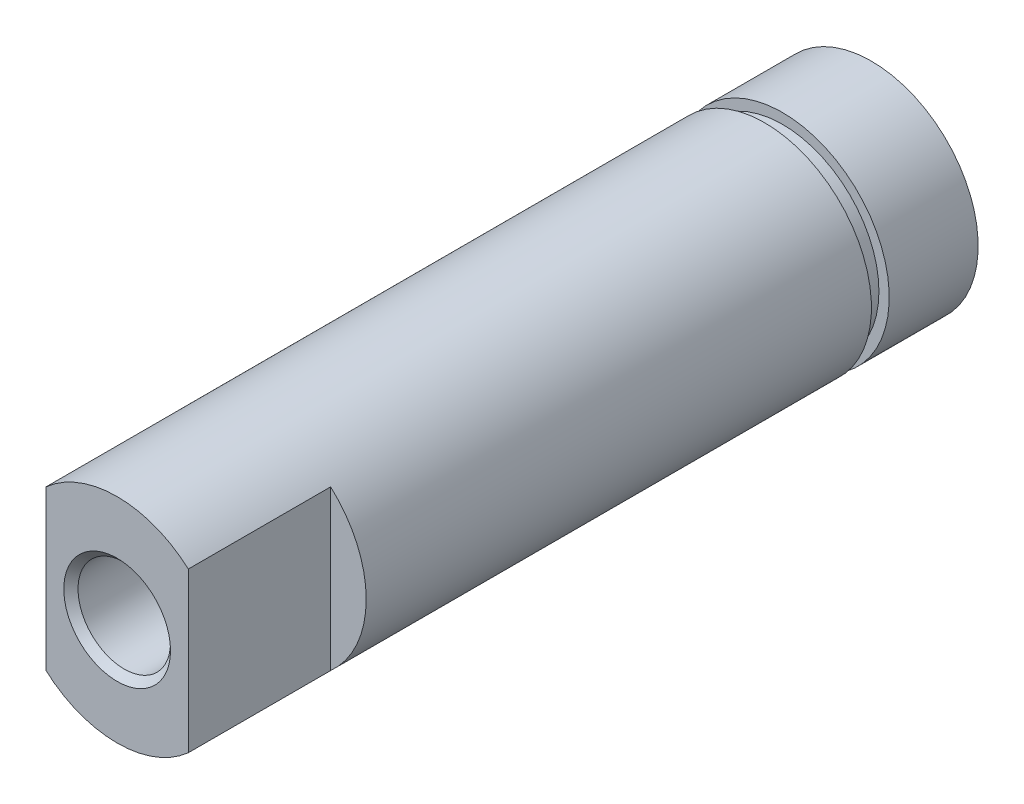
ISO-10303-21;
HEADER;
FILE_DESCRIPTION(('STEP AP214'),'2;1');
FILE_NAME('part.step','',(''),(''),'','','');
FILE_SCHEMA(('AUTOMOTIVE_DESIGN { 1 0 10303 214 1 1 1 1 }'));
ENDSEC;
DATA;
#1=APPLICATION_CONTEXT('core data for automotive mechanical design processes');
#2=APPLICATION_PROTOCOL_DEFINITION('international standard','automotive_design',2000,#1);
#3=PRODUCT_CONTEXT('',#1,'mechanical');
#4=PRODUCT('Part','Part','',(#3));
#5=PRODUCT_RELATED_PRODUCT_CATEGORY('part','',(#4));
#6=PRODUCT_DEFINITION_FORMATION('','',#4);
#7=PRODUCT_DEFINITION_CONTEXT('part definition',#1,'design');
#8=PRODUCT_DEFINITION('design','',#6,#7);
#9=PRODUCT_DEFINITION_SHAPE('','',#8);
#10=(LENGTH_UNIT() NAMED_UNIT(*) SI_UNIT(.MILLI.,.METRE.));
#11=(NAMED_UNIT(*) PLANE_ANGLE_UNIT() SI_UNIT($,.RADIAN.));
#12=(NAMED_UNIT(*) SI_UNIT($,.STERADIAN.) SOLID_ANGLE_UNIT());
#13=UNCERTAINTY_MEASURE_WITH_UNIT(LENGTH_MEASURE(1.E-05),#10,'distance_accuracy_value','');
#14=(GEOMETRIC_REPRESENTATION_CONTEXT(3) GLOBAL_UNCERTAINTY_ASSIGNED_CONTEXT((#13)) GLOBAL_UNIT_ASSIGNED_CONTEXT((#10,
#11,#12)) REPRESENTATION_CONTEXT('',''));
#15=CARTESIAN_POINT('',(0.,0.,0.));
#16=DIRECTION('',(0.,0.,1.));
#17=DIRECTION('',(1.,0.,0.));
#18=AXIS2_PLACEMENT_3D('',#15,#16,#17);
#19=CARTESIAN_POINT('',(0.,0.,6.2));
#20=DIRECTION('',(0.,0.,1.));
#21=DIRECTION('',(1.,0.,0.));
#22=AXIS2_PLACEMENT_3D('',#19,#20,#21);
#23=PLANE('',#22);
#24=CARTESIAN_POINT('',(0.,0.,6.2));
#25=DIRECTION('',(0.,0.,1.));
#26=DIRECTION('',(1.,0.,0.));
#27=AXIS2_PLACEMENT_3D('',#24,#25,#26);
#28=CIRCLE('',#27,1.3);
#29=CARTESIAN_POINT('',(1.3,0.,6.2));
#30=VERTEX_POINT('',#29);
#31=EDGE_CURVE('E27',#30,#30,#28,.F.);
#32=ORIENTED_EDGE('',*,*,#31,.F.);
#33=EDGE_LOOP('',(#32));
#34=FACE_BOUND('',#33,.T.);
#35=ADVANCED_FACE('F24',(#34),#23,.T.);
#36=CARTESIAN_POINT('',(0.,0.,6.2));
#37=DIRECTION('',(0.,0.,1.));
#38=DIRECTION('',(1.,0.,0.));
#39=AXIS2_PLACEMENT_3D('',#36,#37,#38);
#40=CYLINDRICAL_SURFACE('',#39,1.3);
#41=ORIENTED_EDGE('',*,*,#31,.T.);
#42=EDGE_LOOP('',(#41));
#43=FACE_BOUND('',#42,.T.);
#44=CARTESIAN_POINT('',(0.,0.,21.));
#45=DIRECTION('',(0.,0.,1.));
#46=DIRECTION('',(1.,0.,0.));
#47=AXIS2_PLACEMENT_3D('',#44,#45,#46);
#48=CIRCLE('',#47,1.3);
#49=CARTESIAN_POINT('',(1.3,0.,21.));
#50=VERTEX_POINT('',#49);
#51=EDGE_CURVE('E101',#50,#50,#48,.F.);
#52=ORIENTED_EDGE('',*,*,#51,.F.);
#53=EDGE_LOOP('',(#52));
#54=FACE_BOUND('',#53,.T.);
#55=ADVANCED_FACE('F240',(#43,#54),#40,.F.);
#56=CARTESIAN_POINT('',(0.,0.,21.));
#57=DIRECTION('',(0.,0.,1.));
#58=DIRECTION('',(1.,0.,0.));
#59=AXIS2_PLACEMENT_3D('',#56,#57,#58);
#60=CONICAL_SURFACE('',#59,1.3,0.785398163397451);
#61=ORIENTED_EDGE('',*,*,#51,.T.);
#62=EDGE_LOOP('',(#61));
#63=FACE_BOUND('',#62,.T.);
#64=CARTESIAN_POINT('',(0.,0.,21.2));
#65=DIRECTION('',(0.,0.,1.));
#66=DIRECTION('',(1.,0.,0.));
#67=AXIS2_PLACEMENT_3D('',#64,#65,#66);
#68=CIRCLE('',#67,1.5);
#69=CARTESIAN_POINT('',(1.5,0.,21.2));
#70=VERTEX_POINT('',#69);
#71=EDGE_CURVE('E70',#70,#70,#68,.F.);
#72=ORIENTED_EDGE('',*,*,#71,.F.);
#73=EDGE_LOOP('',(#72));
#74=FACE_BOUND('',#73,.T.);
#75=ADVANCED_FACE('F232',(#63,#74),#60,.F.);
#76=CARTESIAN_POINT('',(0.,0.,17.2));
#77=DIRECTION('',(0.,0.,1.));
#78=DIRECTION('',(1.,0.,0.));
#79=AXIS2_PLACEMENT_3D('',#76,#77,#78);
#80=PLANE('',#79);
#81=CARTESIAN_POINT('',(0.,0.,17.2));
#82=DIRECTION('',(0.,0.,-1.));
#83=DIRECTION('',(-1.,0.,0.));
#84=AXIS2_PLACEMENT_3D('',#81,#82,#83);
#85=CIRCLE('',#84,3.);
#86=CARTESIAN_POINT('',(2.00000000012417,2.23606797738873,17.2));
#87=VERTEX_POINT('',#86);
#88=CARTESIAN_POINT('',(2.00000000012417,-2.23606797738872,17.2));
#89=VERTEX_POINT('',#88);
#90=EDGE_CURVE('E79',#87,#89,#85,.T.);
#91=ORIENTED_EDGE('',*,*,#90,.F.);
#92=DIRECTION('',(0.,1.,0.));
#93=VECTOR('',#92,1.);
#94=CARTESIAN_POINT('',(2.,2.808702216,17.2));
#95=LINE('',#94,#93);
#96=EDGE_CURVE('E86',#89,#87,#95,.T.);
#97=ORIENTED_EDGE('',*,*,#96,.F.);
#98=EDGE_LOOP('',(#91,#97));
#99=FACE_BOUND('',#98,.T.);
#100=ADVANCED_FACE('F121',(#99),#80,.T.);
#101=CARTESIAN_POINT('',(0.,0.,17.2));
#102=DIRECTION('',(0.,0.,1.));
#103=DIRECTION('',(1.,0.,0.));
#104=AXIS2_PLACEMENT_3D('',#101,#102,#103);
#105=PLANE('',#104);
#106=CARTESIAN_POINT('',(0.,0.,17.2));
#107=DIRECTION('',(0.,0.,-1.));
#108=DIRECTION('',(-1.,0.,0.));
#109=AXIS2_PLACEMENT_3D('',#106,#107,#108);
#110=CIRCLE('',#109,3.);
#111=CARTESIAN_POINT('',(-2.00000000012417,-2.23606797738873,17.2));
#112=VERTEX_POINT('',#111);
#113=CARTESIAN_POINT('',(-2.00000000012417,2.23606797738873,17.2));
#114=VERTEX_POINT('',#113);
#115=EDGE_CURVE('E117',#112,#114,#110,.T.);
#116=ORIENTED_EDGE('',*,*,#115,.F.);
#117=DIRECTION('',(0.,1.,0.));
#118=VECTOR('',#117,1.);
#119=CARTESIAN_POINT('',(-2.,2.236067977,17.2));
#120=LINE('',#119,#118);
#121=EDGE_CURVE('E71',#114,#112,#120,.F.);
#122=ORIENTED_EDGE('',*,*,#121,.F.);
#123=EDGE_LOOP('',(#116,#122));
#124=FACE_BOUND('',#123,.T.);
#125=ADVANCED_FACE('F216',(#124),#105,.T.);
#126=CARTESIAN_POINT('',(-2.,2.236067977,17.2));
#127=DIRECTION('',(1.,0.,0.));
#128=DIRECTION('',(0.,0.,-1.));
#129=AXIS2_PLACEMENT_3D('',#126,#127,#128);
#130=PLANE('',#129);
#131=ORIENTED_EDGE('',*,*,#121,.T.);
#132=DIRECTION('',(0.,0.,-1.));
#133=VECTOR('',#132,1.);
#134=CARTESIAN_POINT('',(-2.00000000024835,-2.23606797727766,12.1));
#135=LINE('',#134,#133);
#136=CARTESIAN_POINT('',(-2.00000000012417,-2.23606797738873,21.2));
#137=VERTEX_POINT('',#136);
#138=EDGE_CURVE('E75',#137,#112,#135,.T.);
#139=ORIENTED_EDGE('',*,*,#138,.F.);
#140=DIRECTION('',(0.,1.,0.));
#141=VECTOR('',#140,1.);
#142=CARTESIAN_POINT('',(-2.,0.,21.2));
#143=LINE('',#142,#141);
#144=CARTESIAN_POINT('',(-2.00000000012417,2.23606797738873,21.2));
#145=VERTEX_POINT('',#144);
#146=EDGE_CURVE('E59',#145,#137,#143,.F.);
#147=ORIENTED_EDGE('',*,*,#146,.F.);
#148=DIRECTION('',(0.,0.,1.));
#149=VECTOR('',#148,1.);
#150=CARTESIAN_POINT('',(-2.00000000024835,2.23606797727766,12.1));
#151=LINE('',#150,#149);
#152=EDGE_CURVE('E116',#114,#145,#151,.T.);
#153=ORIENTED_EDGE('',*,*,#152,.F.);
#154=EDGE_LOOP('',(#131,#139,#147,#153));
#155=FACE_BOUND('',#154,.T.);
#156=ADVANCED_FACE('F76',(#155),#130,.F.);
#157=CARTESIAN_POINT('',(0.,0.,21.2));
#158=DIRECTION('',(0.,0.,1.));
#159=DIRECTION('',(1.,0.,0.));
#160=AXIS2_PLACEMENT_3D('',#157,#158,#159);
#161=PLANE('',#160);
#162=ORIENTED_EDGE('',*,*,#71,.T.);
#163=EDGE_LOOP('',(#162));
#164=FACE_BOUND('',#163,.T.);
#165=ORIENTED_EDGE('',*,*,#146,.T.);
#166=CARTESIAN_POINT('',(0.,0.,21.2));
#167=DIRECTION('',(0.,0.,-1.));
#168=DIRECTION('',(-1.,0.,0.));
#169=AXIS2_PLACEMENT_3D('',#166,#167,#168);
#170=CIRCLE('',#169,3.);
#171=CARTESIAN_POINT('',(2.00000000012417,-2.23606797738872,21.2));
#172=VERTEX_POINT('',#171);
#173=EDGE_CURVE('E63',#172,#137,#170,.T.);
#174=ORIENTED_EDGE('',*,*,#173,.F.);
#175=DIRECTION('',(0.,1.,0.));
#176=VECTOR('',#175,1.);
#177=CARTESIAN_POINT('',(2.,2.808702216,21.2));
#178=LINE('',#177,#176);
#179=CARTESIAN_POINT('',(2.00000000012417,2.23606797738873,21.2));
#180=VERTEX_POINT('',#179);
#181=EDGE_CURVE('E42',#180,#172,#178,.F.);
#182=ORIENTED_EDGE('',*,*,#181,.F.);
#183=CARTESIAN_POINT('',(0.,0.,21.2));
#184=DIRECTION('',(0.,0.,-1.));
#185=DIRECTION('',(-1.,0.,0.));
#186=AXIS2_PLACEMENT_3D('',#183,#184,#185);
#187=CIRCLE('',#186,3.);
#188=EDGE_CURVE('E66',#145,#180,#187,.T.);
#189=ORIENTED_EDGE('',*,*,#188,.F.);
#190=EDGE_LOOP('',(#165,#174,#182,#189));
#191=FACE_BOUND('',#190,.T.);
#192=ADVANCED_FACE('F61',(#164,#191),#161,.T.);
#193=CARTESIAN_POINT('',(2.,2.808702216,17.2));
#194=DIRECTION('',(-1.,0.,0.));
#195=DIRECTION('',(0.,0.,1.));
#196=AXIS2_PLACEMENT_3D('',#193,#194,#195);
#197=PLANE('',#196);
#198=ORIENTED_EDGE('',*,*,#96,.T.);
#199=DIRECTION('',(0.,0.,-1.));
#200=VECTOR('',#199,1.);
#201=CARTESIAN_POINT('',(2.00000000024835,2.23606797727766,12.1));
#202=LINE('',#201,#200);
#203=EDGE_CURVE('E99',#180,#87,#202,.T.);
#204=ORIENTED_EDGE('',*,*,#203,.F.);
#205=ORIENTED_EDGE('',*,*,#181,.T.);
#206=DIRECTION('',(0.,0.,1.));
#207=VECTOR('',#206,1.);
#208=CARTESIAN_POINT('',(2.00000000024835,-2.23606797727766,12.1));
#209=LINE('',#208,#207);
#210=EDGE_CURVE('E84',#89,#172,#209,.T.);
#211=ORIENTED_EDGE('',*,*,#210,.F.);
#212=EDGE_LOOP('',(#198,#204,#205,#211));
#213=FACE_BOUND('',#212,.T.);
#214=ADVANCED_FACE('F122',(#213),#197,.F.);
#215=CARTESIAN_POINT('',(0.,0.,3.));
#216=DIRECTION('',(0.,0.,-1.));
#217=DIRECTION('',(-1.,0.,0.));
#218=AXIS2_PLACEMENT_3D('',#215,#216,#217);
#219=CYLINDRICAL_SURFACE('',#218,3.);
#220=CARTESIAN_POINT('',(0.,0.,3.));
#221=DIRECTION('',(0.,0.,-1.));
#222=DIRECTION('',(-1.,0.,0.));
#223=AXIS2_PLACEMENT_3D('',#220,#221,#222);
#224=CIRCLE('',#223,3.);
#225=CARTESIAN_POINT('',(-3.,0.,3.));
#226=VERTEX_POINT('',#225);
#227=EDGE_CURVE('E113',#226,#226,#224,.T.);
#228=ORIENTED_EDGE('',*,*,#227,.F.);
#229=EDGE_LOOP('',(#228));
#230=FACE_BOUND('',#229,.T.);
#231=ORIENTED_EDGE('',*,*,#188,.T.);
#232=ORIENTED_EDGE('',*,*,#203,.T.);
#233=ORIENTED_EDGE('',*,*,#90,.T.);
#234=ORIENTED_EDGE('',*,*,#210,.T.);
#235=ORIENTED_EDGE('',*,*,#173,.T.);
#236=ORIENTED_EDGE('',*,*,#138,.T.);
#237=ORIENTED_EDGE('',*,*,#115,.T.);
#238=ORIENTED_EDGE('',*,*,#152,.T.);
#239=EDGE_LOOP('',(#231,#232,#233,#234,#235,#236,#237,#238));
#240=FACE_BOUND('',#239,.T.);
#241=ADVANCED_FACE('F81',(#230,#240),#219,.T.);
#242=CARTESIAN_POINT('',(0.,3.,3.));
#243=DIRECTION('',(0.,0.,-1.));
#244=DIRECTION('',(-1.,0.,0.));
#245=AXIS2_PLACEMENT_3D('',#242,#243,#244);
#246=PLANE('',#245);
#247=CARTESIAN_POINT('',(0.,0.,3.));
#248=DIRECTION('',(0.,0.,1.));
#249=DIRECTION('',(1.,0.,0.));
#250=AXIS2_PLACEMENT_3D('',#247,#248,#249);
#251=CIRCLE('',#250,2.711061342);
#252=CARTESIAN_POINT('',(2.711061342,0.,3.));
#253=VERTEX_POINT('',#252);
#254=EDGE_CURVE('E110',#253,#253,#251,.F.);
#255=ORIENTED_EDGE('',*,*,#254,.F.);
#256=EDGE_LOOP('',(#255));
#257=FACE_BOUND('',#256,.T.);
#258=ORIENTED_EDGE('',*,*,#227,.T.);
#259=EDGE_LOOP('',(#258));
#260=FACE_BOUND('',#259,.T.);
#261=ADVANCED_FACE('F130',(#257,#260),#246,.T.);
#262=CARTESIAN_POINT('',(0.,0.,3.));
#263=DIRECTION('',(0.,0.,1.));
#264=DIRECTION('',(1.,0.,0.));
#265=AXIS2_PLACEMENT_3D('',#262,#263,#264);
#266=CYLINDRICAL_SURFACE('',#265,2.711061342);
#267=CARTESIAN_POINT('',(0.,0.,2.5));
#268=DIRECTION('',(0.,0.,1.));
#269=DIRECTION('',(1.,0.,0.));
#270=AXIS2_PLACEMENT_3D('',#267,#268,#269);
#271=CIRCLE('',#270,2.711061342);
#272=CARTESIAN_POINT('',(2.711061342,0.,2.5));
#273=VERTEX_POINT('',#272);
#274=EDGE_CURVE('E107',#273,#273,#271,.F.);
#275=ORIENTED_EDGE('',*,*,#274,.F.);
#276=EDGE_LOOP('',(#275));
#277=FACE_BOUND('',#276,.T.);
#278=ORIENTED_EDGE('',*,*,#254,.T.);
#279=EDGE_LOOP('',(#278));
#280=FACE_BOUND('',#279,.T.);
#281=ADVANCED_FACE('F149',(#277,#280),#266,.T.);
#282=CARTESIAN_POINT('',(0.,3.,2.5));
#283=DIRECTION('',(0.,0.,1.));
#284=DIRECTION('',(1.,0.,0.));
#285=AXIS2_PLACEMENT_3D('',#282,#283,#284);
#286=PLANE('',#285);
#287=ORIENTED_EDGE('',*,*,#274,.T.);
#288=EDGE_LOOP('',(#287));
#289=FACE_BOUND('',#288,.T.);
#290=CARTESIAN_POINT('',(0.,0.,2.5));
#291=DIRECTION('',(0.,0.,-1.));
#292=DIRECTION('',(-1.,0.,0.));
#293=AXIS2_PLACEMENT_3D('',#290,#291,#292);
#294=CIRCLE('',#293,3.);
#295=CARTESIAN_POINT('',(-3.,0.,2.5));
#296=VERTEX_POINT('',#295);
#297=EDGE_CURVE('E33',#296,#296,#294,.T.);
#298=ORIENTED_EDGE('',*,*,#297,.F.);
#299=EDGE_LOOP('',(#298));
#300=FACE_BOUND('',#299,.T.);
#301=ADVANCED_FACE('F142',(#289,#300),#286,.T.);
#302=CARTESIAN_POINT('',(0.,0.,0.));
#303=DIRECTION('',(0.,0.,1.));
#304=DIRECTION('',(1.,0.,0.));
#305=AXIS2_PLACEMENT_3D('',#302,#303,#304);
#306=PLANE('',#305);
#307=CARTESIAN_POINT('',(0.,0.,0.));
#308=DIRECTION('',(0.,0.,-1.));
#309=DIRECTION('',(-1.,0.,0.));
#310=AXIS2_PLACEMENT_3D('',#307,#308,#309);
#311=CIRCLE('',#310,3.);
#312=CARTESIAN_POINT('',(-3.,0.,0.));
#313=VERTEX_POINT('',#312);
#314=EDGE_CURVE('E13',#313,#313,#311,.F.);
#315=ORIENTED_EDGE('',*,*,#314,.F.);
#316=EDGE_LOOP('',(#315));
#317=FACE_BOUND('',#316,.T.);
#318=ADVANCED_FACE('F136',(#317),#306,.F.);
#319=CARTESIAN_POINT('',(0.,0.,0.));
#320=DIRECTION('',(0.,0.,-1.));
#321=DIRECTION('',(-1.,0.,0.));
#322=AXIS2_PLACEMENT_3D('',#319,#320,#321);
#323=CYLINDRICAL_SURFACE('',#322,3.);
#324=ORIENTED_EDGE('',*,*,#314,.T.);
#325=EDGE_LOOP('',(#324));
#326=FACE_BOUND('',#325,.T.);
#327=ORIENTED_EDGE('',*,*,#297,.T.);
#328=EDGE_LOOP('',(#327));
#329=FACE_BOUND('',#328,.T.);
#330=ADVANCED_FACE('F134',(#326,#329),#323,.T.);
#331=CLOSED_SHELL('',(#35,#55,#75,#100,#125,#156,#192,#214,#241,#261,#281,#301,#318,#330));
#332=MANIFOLD_SOLID_BREP('B1',#331);
#333=ADVANCED_BREP_SHAPE_REPRESENTATION('',(#18,#332),#14);
#334=SHAPE_DEFINITION_REPRESENTATION(#9,#333);
ENDSEC;
END-ISO-10303-21;
